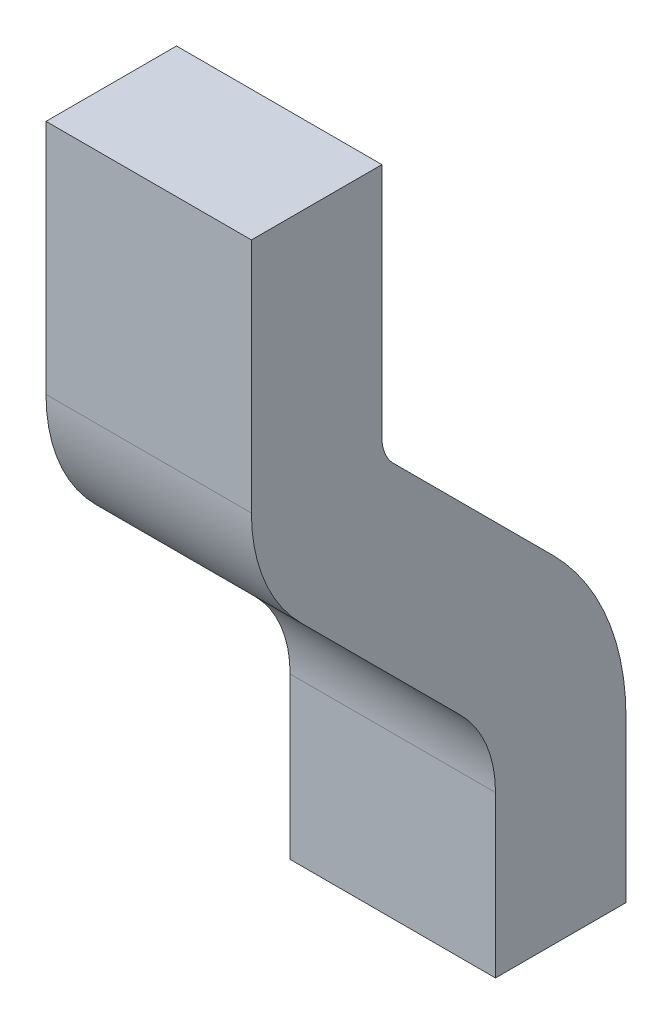
ISO-10303-21;
HEADER;
FILE_DESCRIPTION(('STEP AP214'),'2;1');
FILE_NAME('part.step','',(''),(''),'','','');
FILE_SCHEMA(('AUTOMOTIVE_DESIGN { 1 0 10303 214 1 1 1 1 }'));
ENDSEC;
DATA;
#1=APPLICATION_CONTEXT('core data for automotive mechanical design processes');
#2=APPLICATION_PROTOCOL_DEFINITION('international standard','automotive_design',2000,#1);
#3=PRODUCT_CONTEXT('',#1,'mechanical');
#4=PRODUCT('Part','Part','',(#3));
#5=PRODUCT_RELATED_PRODUCT_CATEGORY('part','',(#4));
#6=PRODUCT_DEFINITION_FORMATION('','',#4);
#7=PRODUCT_DEFINITION_CONTEXT('part definition',#1,'design');
#8=PRODUCT_DEFINITION('design','',#6,#7);
#9=PRODUCT_DEFINITION_SHAPE('','',#8);
#10=(LENGTH_UNIT() NAMED_UNIT(*) SI_UNIT(.MILLI.,.METRE.));
#11=(NAMED_UNIT(*) PLANE_ANGLE_UNIT() SI_UNIT($,.RADIAN.));
#12=(NAMED_UNIT(*) SI_UNIT($,.STERADIAN.) SOLID_ANGLE_UNIT());
#13=UNCERTAINTY_MEASURE_WITH_UNIT(LENGTH_MEASURE(1.E-05),#10,'distance_accuracy_value','');
#14=(GEOMETRIC_REPRESENTATION_CONTEXT(3) GLOBAL_UNCERTAINTY_ASSIGNED_CONTEXT((#13)) GLOBAL_UNIT_ASSIGNED_CONTEXT((#10,
#11,#12)) REPRESENTATION_CONTEXT('',''));
#15=CARTESIAN_POINT('',(0.,0.,0.));
#16=DIRECTION('',(0.,0.,1.));
#17=DIRECTION('',(1.,0.,0.));
#18=AXIS2_PLACEMENT_3D('',#15,#16,#17);
#19=CARTESIAN_POINT('',(0.425,-1.00000000000062,0.54));
#20=DIRECTION('',(0.,0.,1.));
#21=DIRECTION('',(0.707106781186548,0.707106781186548,0.));
#22=AXIS2_PLACEMENT_3D('',#19,#20,#21);
#23=PLANE('',#22);
#24=DIRECTION('',(0.,1.,0.));
#25=VECTOR('',#24,1.);
#26=CARTESIAN_POINT('',(0.425,-1.00000000000062,0.54));
#27=LINE('',#26,#25);
#28=CARTESIAN_POINT('',(0.425,-1.00000000000062,0.54));
#29=VERTEX_POINT('',#28);
#30=CARTESIAN_POINT('',(0.425,-0.335269905174204,0.54));
#31=VERTEX_POINT('',#30);
#32=EDGE_CURVE('E11',#29,#31,#27,.T.);
#33=ORIENTED_EDGE('',*,*,#32,.T.);
#34=DIRECTION('',(-1.,0.,0.));
#35=VECTOR('',#34,1.);
#36=CARTESIAN_POINT('',(0.425,-0.335269905174204,0.54));
#37=LINE('',#36,#35);
#38=CARTESIAN_POINT('',(-0.425,-0.335269905174204,0.54));
#39=VERTEX_POINT('',#38);
#40=EDGE_CURVE('E26',#31,#39,#37,.T.);
#41=ORIENTED_EDGE('',*,*,#40,.T.);
#42=DIRECTION('',(0.,1.,0.));
#43=VECTOR('',#42,1.);
#44=CARTESIAN_POINT('',(-0.425,-1.00000000000062,0.54));
#45=LINE('',#44,#43);
#46=CARTESIAN_POINT('',(-0.425,-1.00000000000062,0.54));
#47=VERTEX_POINT('',#46);
#48=EDGE_CURVE('E127',#47,#39,#45,.T.);
#49=ORIENTED_EDGE('',*,*,#48,.F.);
#50=DIRECTION('',(-1.,0.,0.));
#51=VECTOR('',#50,1.);
#52=CARTESIAN_POINT('',(0.425,-1.00000000000062,0.54));
#53=LINE('',#52,#51);
#54=EDGE_CURVE('E124',#29,#47,#53,.T.);
#55=ORIENTED_EDGE('',*,*,#54,.F.);
#56=EDGE_LOOP('',(#33,#41,#49,#55));
#57=FACE_BOUND('',#56,.T.);
#58=ADVANCED_FACE('F16',(#57),#23,.T.);
#59=CARTESIAN_POINT('',(0.425,-0.335269905174204,1.03522017196621));
#60=DIRECTION('',(1.,0.,0.));
#61=DIRECTION('',(0.,0.,-1.));
#62=AXIS2_PLACEMENT_3D('',#59,#60,#61);
#63=CYLINDRICAL_SURFACE('',#62,0.495220171966211);
#64=CARTESIAN_POINT('',(0.425,-0.335269905174204,1.03522017196621));
#65=DIRECTION('',(1.,0.,0.));
#66=DIRECTION('',(0.,0.,-1.));
#67=AXIS2_PLACEMENT_3D('',#64,#65,#66);
#68=CIRCLE('',#67,0.495220171966211);
#69=CARTESIAN_POINT('',(0.425,0.0149036364441688,0.685046629849319));
#70=VERTEX_POINT('',#69);
#71=EDGE_CURVE('E133',#31,#70,#68,.T.);
#72=ORIENTED_EDGE('',*,*,#71,.T.);
#73=DIRECTION('',(-1.,0.,0.));
#74=VECTOR('',#73,1.);
#75=CARTESIAN_POINT('',(0.425,0.0149036364441688,0.685046629849319));
#76=LINE('',#75,#74);
#77=CARTESIAN_POINT('',(-0.425,0.0149036364441688,0.685046629849319));
#78=VERTEX_POINT('',#77);
#79=EDGE_CURVE('E135',#70,#78,#76,.T.);
#80=ORIENTED_EDGE('',*,*,#79,.T.);
#81=CARTESIAN_POINT('',(-0.425,-0.335269905174204,1.03522017196621));
#82=DIRECTION('',(1.,0.,0.));
#83=DIRECTION('',(0.,0.,-1.));
#84=AXIS2_PLACEMENT_3D('',#81,#82,#83);
#85=CIRCLE('',#84,0.495220171966211);
#86=EDGE_CURVE('E129',#39,#78,#85,.T.);
#87=ORIENTED_EDGE('',*,*,#86,.F.);
#88=ORIENTED_EDGE('',*,*,#40,.F.);
#89=EDGE_LOOP('',(#72,#80,#87,#88));
#90=FACE_BOUND('',#89,.T.);
#91=ADVANCED_FACE('F208',(#90),#63,.F.);
#92=CARTESIAN_POINT('',(0.425,0.0149036364441688,0.685046629849319));
#93=DIRECTION('',(0.,-0.707106781186548,0.707106781186547));
#94=DIRECTION('',(0.577350269189626,0.577350269189625,0.577350269189626));
#95=AXIS2_PLACEMENT_3D('',#92,#93,#94);
#96=PLANE('',#95);
#97=DIRECTION('',(0.,0.707106781186547,0.707106781186548));
#98=VECTOR('',#97,1.);
#99=CARTESIAN_POINT('',(0.425,0.0149036364441688,0.685046629849319));
#100=LINE('',#99,#98);
#101=CARTESIAN_POINT('',(0.425,0.673775371184803,1.34391836454678));
#102=VERTEX_POINT('',#101);
#103=EDGE_CURVE('E138',#70,#102,#100,.T.);
#104=ORIENTED_EDGE('',*,*,#103,.T.);
#105=DIRECTION('',(-1.,0.,0.));
#106=VECTOR('',#105,1.);
#107=CARTESIAN_POINT('',(0.425,0.673775370965807,1.34391836437096));
#108=LINE('',#107,#106);
#109=CARTESIAN_POINT('',(-0.425,0.673775371184803,1.34391836454678));
#110=VERTEX_POINT('',#109);
#111=EDGE_CURVE('E143',#102,#110,#108,.T.);
#112=ORIENTED_EDGE('',*,*,#111,.T.);
#113=DIRECTION('',(0.,0.707106781186547,0.707106781186548));
#114=VECTOR('',#113,1.);
#115=CARTESIAN_POINT('',(-0.425,0.0149036364441688,0.685046629849319));
#116=LINE('',#115,#114);
#117=EDGE_CURVE('E140',#78,#110,#116,.T.);
#118=ORIENTED_EDGE('',*,*,#117,.F.);
#119=ORIENTED_EDGE('',*,*,#79,.F.);
#120=EDGE_LOOP('',(#104,#112,#118,#119));
#121=FACE_BOUND('',#120,.T.);
#122=ADVANCED_FACE('F212',(#121),#96,.T.);
#123=CARTESIAN_POINT('',(0.425,1.17130045081576,0.846393284401388));
#124=DIRECTION('',(-1.,0.,0.));
#125=DIRECTION('',(0.,-0.707106780820972,0.707106781552123));
#126=AXIS2_PLACEMENT_3D('',#123,#124,#125);
#127=CYLINDRICAL_SURFACE('',#126,0.703606715598613);
#128=CARTESIAN_POINT('',(0.425,1.17130045081576,0.846393284401388));
#129=DIRECTION('',(-1.,0.,0.));
#130=DIRECTION('',(0.,-0.707106780820972,0.707106781552123));
#131=AXIS2_PLACEMENT_3D('',#128,#129,#130);
#132=CIRCLE('',#131,0.703606715598613);
#133=CARTESIAN_POINT('',(0.425,1.17130045081576,1.55));
#134=VERTEX_POINT('',#133);
#135=EDGE_CURVE('E146',#102,#134,#132,.T.);
#136=ORIENTED_EDGE('',*,*,#135,.T.);
#137=DIRECTION('',(-1.,0.,0.));
#138=VECTOR('',#137,1.);
#139=CARTESIAN_POINT('',(0.425,1.17130045081576,1.55));
#140=LINE('',#139,#138);
#141=CARTESIAN_POINT('',(-0.425,1.17130045081576,1.55));
#142=VERTEX_POINT('',#141);
#143=EDGE_CURVE('E151',#134,#142,#140,.T.);
#144=ORIENTED_EDGE('',*,*,#143,.T.);
#145=CARTESIAN_POINT('',(-0.425,1.17130045081576,0.846393284401388));
#146=DIRECTION('',(-1.,0.,0.));
#147=DIRECTION('',(0.,-0.707106780820972,0.707106781552123));
#148=AXIS2_PLACEMENT_3D('',#145,#146,#147);
#149=CIRCLE('',#148,0.703606715598613);
#150=EDGE_CURVE('E148',#110,#142,#149,.T.);
#151=ORIENTED_EDGE('',*,*,#150,.F.);
#152=ORIENTED_EDGE('',*,*,#111,.F.);
#153=EDGE_LOOP('',(#136,#144,#151,#152));
#154=FACE_BOUND('',#153,.T.);
#155=ADVANCED_FACE('F215',(#154),#127,.T.);
#156=CARTESIAN_POINT('',(0.425,1.17130045081576,1.55));
#157=DIRECTION('',(0.,0.,1.));
#158=DIRECTION('',(0.707106781186548,0.707106781186548,0.));
#159=AXIS2_PLACEMENT_3D('',#156,#157,#158);
#160=PLANE('',#159);
#161=DIRECTION('',(0.,1.,0.));
#162=VECTOR('',#161,1.);
#163=CARTESIAN_POINT('',(0.425,1.17130045081576,1.55));
#164=LINE('',#163,#162);
#165=CARTESIAN_POINT('',(0.425,2.14999999999938,1.55));
#166=VERTEX_POINT('',#165);
#167=EDGE_CURVE('E154',#134,#166,#164,.T.);
#168=ORIENTED_EDGE('',*,*,#167,.T.);
#169=DIRECTION('',(-1.,0.,0.));
#170=VECTOR('',#169,1.);
#171=CARTESIAN_POINT('',(0.425,2.14999999999938,1.55));
#172=LINE('',#171,#170);
#173=CARTESIAN_POINT('',(-0.425,2.14999999999938,1.55));
#174=VERTEX_POINT('',#173);
#175=EDGE_CURVE('E159',#166,#174,#172,.T.);
#176=ORIENTED_EDGE('',*,*,#175,.T.);
#177=DIRECTION('',(0.,1.,0.));
#178=VECTOR('',#177,1.);
#179=CARTESIAN_POINT('',(-0.425,1.17130045081576,1.55));
#180=LINE('',#179,#178);
#181=EDGE_CURVE('E156',#142,#174,#180,.T.);
#182=ORIENTED_EDGE('',*,*,#181,.F.);
#183=ORIENTED_EDGE('',*,*,#143,.F.);
#184=EDGE_LOOP('',(#168,#176,#182,#183));
#185=FACE_BOUND('',#184,.T.);
#186=ADVANCED_FACE('F219',(#185),#160,.T.);
#187=CARTESIAN_POINT('',(0.425,2.14999999999938,1.55));
#188=DIRECTION('',(0.,1.,0.));
#189=DIRECTION('',(0.707106781186548,0.,0.707106781186548));
#190=AXIS2_PLACEMENT_3D('',#187,#188,#189);
#191=PLANE('',#190);
#192=DIRECTION('',(0.,0.,-1.));
#193=VECTOR('',#192,1.);
#194=CARTESIAN_POINT('',(0.425,2.14999999999938,1.55));
#195=LINE('',#194,#193);
#196=CARTESIAN_POINT('',(0.425,2.14999999999938,1.01));
#197=VERTEX_POINT('',#196);
#198=EDGE_CURVE('E162',#166,#197,#195,.T.);
#199=ORIENTED_EDGE('',*,*,#198,.T.);
#200=DIRECTION('',(-1.,0.,0.));
#201=VECTOR('',#200,1.);
#202=CARTESIAN_POINT('',(0.425,2.14999999999938,1.01));
#203=LINE('',#202,#201);
#204=CARTESIAN_POINT('',(-0.425,2.14999999999938,1.01));
#205=VERTEX_POINT('',#204);
#206=EDGE_CURVE('E167',#197,#205,#203,.T.);
#207=ORIENTED_EDGE('',*,*,#206,.T.);
#208=DIRECTION('',(0.,0.,-1.));
#209=VECTOR('',#208,1.);
#210=CARTESIAN_POINT('',(-0.425,2.14999999999938,1.55));
#211=LINE('',#210,#209);
#212=EDGE_CURVE('E164',#174,#205,#211,.T.);
#213=ORIENTED_EDGE('',*,*,#212,.F.);
#214=ORIENTED_EDGE('',*,*,#175,.F.);
#215=EDGE_LOOP('',(#199,#207,#213,#214));
#216=FACE_BOUND('',#215,.T.);
#217=ADVANCED_FACE('F223',(#216),#191,.T.);
#218=CARTESIAN_POINT('',(0.425,2.14999999999938,1.01));
#219=DIRECTION('',(0.,0.,-1.));
#220=DIRECTION('',(0.707106781186548,0.707106781186548,0.));
#221=AXIS2_PLACEMENT_3D('',#218,#219,#220);
#222=PLANE('',#221);
#223=DIRECTION('',(0.,-1.,0.));
#224=VECTOR('',#223,1.);
#225=CARTESIAN_POINT('',(0.425,2.14999999999938,1.01));
#226=LINE('',#225,#224);
#227=CARTESIAN_POINT('',(0.425,1.17130045081576,1.01));
#228=VERTEX_POINT('',#227);
#229=EDGE_CURVE('E170',#197,#228,#226,.T.);
#230=ORIENTED_EDGE('',*,*,#229,.T.);
#231=DIRECTION('',(-1.,0.,0.));
#232=VECTOR('',#231,1.);
#233=CARTESIAN_POINT('',(0.425,1.17130045081576,1.01));
#234=LINE('',#233,#232);
#235=CARTESIAN_POINT('',(-0.425,1.17130045081576,1.01));
#236=VERTEX_POINT('',#235);
#237=EDGE_CURVE('E175',#228,#236,#234,.T.);
#238=ORIENTED_EDGE('',*,*,#237,.T.);
#239=DIRECTION('',(0.,-1.,0.));
#240=VECTOR('',#239,1.);
#241=CARTESIAN_POINT('',(-0.425,2.14999999999938,1.01));
#242=LINE('',#241,#240);
#243=EDGE_CURVE('E172',#205,#236,#242,.T.);
#244=ORIENTED_EDGE('',*,*,#243,.F.);
#245=ORIENTED_EDGE('',*,*,#206,.F.);
#246=EDGE_LOOP('',(#230,#238,#244,#245));
#247=FACE_BOUND('',#246,.T.);
#248=ADVANCED_FACE('F227',(#247),#222,.T.);
#249=CARTESIAN_POINT('',(0.425,1.17130045081576,0.846393284401388));
#250=DIRECTION('',(1.,0.,0.));
#251=DIRECTION('',(0.,0.,1.));
#252=AXIS2_PLACEMENT_3D('',#249,#250,#251);
#253=CYLINDRICAL_SURFACE('',#252,0.163606715598613);
#254=CARTESIAN_POINT('',(0.425,1.17130045081576,0.846393284401388));
#255=DIRECTION('',(1.,0.,0.));
#256=DIRECTION('',(0.,0.,1.));
#257=AXIS2_PLACEMENT_3D('',#254,#255,#256);
#258=CIRCLE('',#257,0.163606715598613);
#259=CARTESIAN_POINT('',(0.425,1.05561303280654,0.962080702530221));
#260=VERTEX_POINT('',#259);
#261=EDGE_CURVE('E178',#228,#260,#258,.T.);
#262=ORIENTED_EDGE('',*,*,#261,.T.);
#263=DIRECTION('',(-1.,0.,0.));
#264=VECTOR('',#263,1.);
#265=CARTESIAN_POINT('',(0.425,1.05561303280654,0.962080702530221));
#266=LINE('',#265,#264);
#267=CARTESIAN_POINT('',(-0.425,1.05561303280654,0.962080702530221));
#268=VERTEX_POINT('',#267);
#269=EDGE_CURVE('E183',#260,#268,#266,.T.);
#270=ORIENTED_EDGE('',*,*,#269,.T.);
#271=CARTESIAN_POINT('',(-0.425,1.17130045081576,0.846393284401388));
#272=DIRECTION('',(1.,0.,0.));
#273=DIRECTION('',(0.,0.,1.));
#274=AXIS2_PLACEMENT_3D('',#271,#272,#273);
#275=CIRCLE('',#274,0.163606715598613);
#276=EDGE_CURVE('E180',#236,#268,#275,.T.);
#277=ORIENTED_EDGE('',*,*,#276,.F.);
#278=ORIENTED_EDGE('',*,*,#237,.F.);
#279=EDGE_LOOP('',(#262,#270,#277,#278));
#280=FACE_BOUND('',#279,.T.);
#281=ADVANCED_FACE('F231',(#280),#253,.F.);
#282=CARTESIAN_POINT('',(0.425,1.05561303280654,0.962080702530221));
#283=DIRECTION('',(0.,0.707106781186548,-0.707106781186547));
#284=DIRECTION('',(0.577350269189626,0.577350269189625,0.577350269189626));
#285=AXIS2_PLACEMENT_3D('',#282,#283,#284);
#286=PLANE('',#285);
#287=DIRECTION('',(0.,-0.707106781186547,-0.707106781186548));
#288=VECTOR('',#287,1.);
#289=CARTESIAN_POINT('',(0.425,1.05561303280654,0.962080702530221));
#290=LINE('',#289,#288);
#291=CARTESIAN_POINT('',(0.425,0.396741298194948,0.30320896809854));
#292=VERTEX_POINT('',#291);
#293=EDGE_CURVE('E186',#260,#292,#290,.T.);
#294=ORIENTED_EDGE('',*,*,#293,.T.);
#295=DIRECTION('',(-1.,0.,0.));
#296=VECTOR('',#295,1.);
#297=CARTESIAN_POINT('',(0.425,0.396741298284904,0.303208968008583));
#298=LINE('',#297,#296);
#299=CARTESIAN_POINT('',(-0.425,0.396741298194948,0.30320896809854));
#300=VERTEX_POINT('',#299);
#301=EDGE_CURVE('E191',#292,#300,#298,.T.);
#302=ORIENTED_EDGE('',*,*,#301,.T.);
#303=DIRECTION('',(0.,-0.707106781186547,-0.707106781186548));
#304=VECTOR('',#303,1.);
#305=CARTESIAN_POINT('',(-0.425,1.05561303280654,0.962080702530221));
#306=LINE('',#305,#304);
#307=EDGE_CURVE('E188',#268,#300,#306,.T.);
#308=ORIENTED_EDGE('',*,*,#307,.F.);
#309=ORIENTED_EDGE('',*,*,#269,.F.);
#310=EDGE_LOOP('',(#294,#302,#308,#309));
#311=FACE_BOUND('',#310,.T.);
#312=ADVANCED_FACE('F234',(#311),#286,.T.);
#313=CARTESIAN_POINT('',(0.425,-0.335269905174204,1.03522017196621));
#314=DIRECTION('',(-1.,0.,0.));
#315=DIRECTION('',(0.,0.707106780945768,-0.707106781427327));
#316=AXIS2_PLACEMENT_3D('',#313,#314,#315);
#317=CYLINDRICAL_SURFACE('',#316,1.03522017196621);
#318=CARTESIAN_POINT('',(0.425,-0.335269905174204,1.03522017196621));
#319=DIRECTION('',(-1.,0.,0.));
#320=DIRECTION('',(0.,0.707106780945768,-0.707106781427327));
#321=AXIS2_PLACEMENT_3D('',#318,#319,#320);
#322=CIRCLE('',#321,1.03522017196621);
#323=CARTESIAN_POINT('',(0.425,-0.335269905174204,0.));
#324=VERTEX_POINT('',#323);
#325=EDGE_CURVE('E194',#292,#324,#322,.T.);
#326=ORIENTED_EDGE('',*,*,#325,.T.);
#327=DIRECTION('',(-1.,0.,0.));
#328=VECTOR('',#327,1.);
#329=CARTESIAN_POINT('',(0.425,-0.335269905174204,0.));
#330=LINE('',#329,#328);
#331=CARTESIAN_POINT('',(-0.425,-0.335269905174204,0.));
#332=VERTEX_POINT('',#331);
#333=EDGE_CURVE('E198',#324,#332,#330,.T.);
#334=ORIENTED_EDGE('',*,*,#333,.T.);
#335=CARTESIAN_POINT('',(-0.425,-0.335269905174204,1.03522017196621));
#336=DIRECTION('',(-1.,0.,0.));
#337=DIRECTION('',(0.,0.707106780945768,-0.707106781427327));
#338=AXIS2_PLACEMENT_3D('',#335,#336,#337);
#339=CIRCLE('',#338,1.03522017196621);
#340=EDGE_CURVE('E111',#300,#332,#339,.T.);
#341=ORIENTED_EDGE('',*,*,#340,.F.);
#342=ORIENTED_EDGE('',*,*,#301,.F.);
#343=EDGE_LOOP('',(#326,#334,#341,#342));
#344=FACE_BOUND('',#343,.T.);
#345=ADVANCED_FACE('F202',(#344),#317,.T.);
#346=CARTESIAN_POINT('',(0.425,-0.335269905174204,0.));
#347=DIRECTION('',(0.,0.,-1.));
#348=DIRECTION('',(0.707106781186548,0.707106781186548,0.));
#349=AXIS2_PLACEMENT_3D('',#346,#347,#348);
#350=PLANE('',#349);
#351=DIRECTION('',(0.,-1.,0.));
#352=VECTOR('',#351,1.);
#353=CARTESIAN_POINT('',(0.425,-0.335269905174204,0.));
#354=LINE('',#353,#352);
#355=CARTESIAN_POINT('',(0.425,-1.00000000000062,0.));
#356=VERTEX_POINT('',#355);
#357=EDGE_CURVE('E117',#324,#356,#354,.T.);
#358=ORIENTED_EDGE('',*,*,#357,.T.);
#359=DIRECTION('',(-1.,0.,0.));
#360=VECTOR('',#359,1.);
#361=CARTESIAN_POINT('',(0.425,-1.00000000000062,0.));
#362=LINE('',#361,#360);
#363=CARTESIAN_POINT('',(-0.425,-1.00000000000062,0.));
#364=VERTEX_POINT('',#363);
#365=EDGE_CURVE('E102',#356,#364,#362,.T.);
#366=ORIENTED_EDGE('',*,*,#365,.T.);
#367=DIRECTION('',(0.,-1.,0.));
#368=VECTOR('',#367,1.);
#369=CARTESIAN_POINT('',(-0.425,-0.335269905174204,0.));
#370=LINE('',#369,#368);
#371=EDGE_CURVE('E108',#332,#364,#370,.T.);
#372=ORIENTED_EDGE('',*,*,#371,.F.);
#373=ORIENTED_EDGE('',*,*,#333,.F.);
#374=EDGE_LOOP('',(#358,#366,#372,#373));
#375=FACE_BOUND('',#374,.T.);
#376=ADVANCED_FACE('F115',(#375),#350,.T.);
#377=CARTESIAN_POINT('',(0.425,-1.00000000000062,0.));
#378=DIRECTION('',(0.,-1.,0.));
#379=DIRECTION('',(0.707106781186548,0.,0.707106781186548));
#380=AXIS2_PLACEMENT_3D('',#377,#378,#379);
#381=PLANE('',#380);
#382=DIRECTION('',(0.,0.,1.));
#383=VECTOR('',#382,1.);
#384=CARTESIAN_POINT('',(0.425,-1.00000000000062,0.));
#385=LINE('',#384,#383);
#386=EDGE_CURVE('E119',#356,#29,#385,.T.);
#387=ORIENTED_EDGE('',*,*,#386,.T.);
#388=ORIENTED_EDGE('',*,*,#54,.T.);
#389=DIRECTION('',(0.,0.,1.));
#390=VECTOR('',#389,1.);
#391=CARTESIAN_POINT('',(-0.425,-1.00000000000062,0.));
#392=LINE('',#391,#390);
#393=EDGE_CURVE('E20',#364,#47,#392,.T.);
#394=ORIENTED_EDGE('',*,*,#393,.F.);
#395=ORIENTED_EDGE('',*,*,#365,.F.);
#396=EDGE_LOOP('',(#387,#388,#394,#395));
#397=FACE_BOUND('',#396,.T.);
#398=ADVANCED_FACE('F122',(#397),#381,.T.);
#399=CARTESIAN_POINT('',(-0.425,0.,0.));
#400=DIRECTION('',(-1.,0.,0.));
#401=DIRECTION('',(0.,0.707106781186548,0.707106781186548));
#402=AXIS2_PLACEMENT_3D('',#399,#400,#401);
#403=PLANE('',#402);
#404=ORIENTED_EDGE('',*,*,#48,.T.);
#405=ORIENTED_EDGE('',*,*,#86,.T.);
#406=ORIENTED_EDGE('',*,*,#117,.T.);
#407=ORIENTED_EDGE('',*,*,#150,.T.);
#408=ORIENTED_EDGE('',*,*,#181,.T.);
#409=ORIENTED_EDGE('',*,*,#212,.T.);
#410=ORIENTED_EDGE('',*,*,#243,.T.);
#411=ORIENTED_EDGE('',*,*,#276,.T.);
#412=ORIENTED_EDGE('',*,*,#307,.T.);
#413=ORIENTED_EDGE('',*,*,#340,.T.);
#414=ORIENTED_EDGE('',*,*,#371,.T.);
#415=ORIENTED_EDGE('',*,*,#393,.T.);
#416=EDGE_LOOP('',(#404,#405,#406,#407,#408,#409,#410,#411,#412,#413,#414,#415));
#417=FACE_BOUND('',#416,.T.);
#418=ADVANCED_FACE('F109',(#417),#403,.T.);
#419=CARTESIAN_POINT('',(0.425,0.,0.));
#420=DIRECTION('',(-1.,0.,0.));
#421=DIRECTION('',(0.,0.707106781186548,0.707106781186548));
#422=AXIS2_PLACEMENT_3D('',#419,#420,#421);
#423=PLANE('',#422);
#424=ORIENTED_EDGE('',*,*,#386,.F.);
#425=ORIENTED_EDGE('',*,*,#357,.F.);
#426=ORIENTED_EDGE('',*,*,#325,.F.);
#427=ORIENTED_EDGE('',*,*,#293,.F.);
#428=ORIENTED_EDGE('',*,*,#261,.F.);
#429=ORIENTED_EDGE('',*,*,#229,.F.);
#430=ORIENTED_EDGE('',*,*,#198,.F.);
#431=ORIENTED_EDGE('',*,*,#167,.F.);
#432=ORIENTED_EDGE('',*,*,#135,.F.);
#433=ORIENTED_EDGE('',*,*,#103,.F.);
#434=ORIENTED_EDGE('',*,*,#71,.F.);
#435=ORIENTED_EDGE('',*,*,#32,.F.);
#436=EDGE_LOOP('',(#424,#425,#426,#427,#428,#429,#430,#431,#432,#433,#434,#435));
#437=FACE_BOUND('',#436,.T.);
#438=ADVANCED_FACE('F18',(#437),#423,.F.);
#439=CLOSED_SHELL('',(#58,#91,#122,#155,#186,#217,#248,#281,#312,#345,#376,#398,#418,#438));
#440=MANIFOLD_SOLID_BREP('B1',#439);
#441=ADVANCED_BREP_SHAPE_REPRESENTATION('',(#18,#440),#14);
#442=SHAPE_DEFINITION_REPRESENTATION(#9,#441);
ENDSEC;
END-ISO-10303-21;
